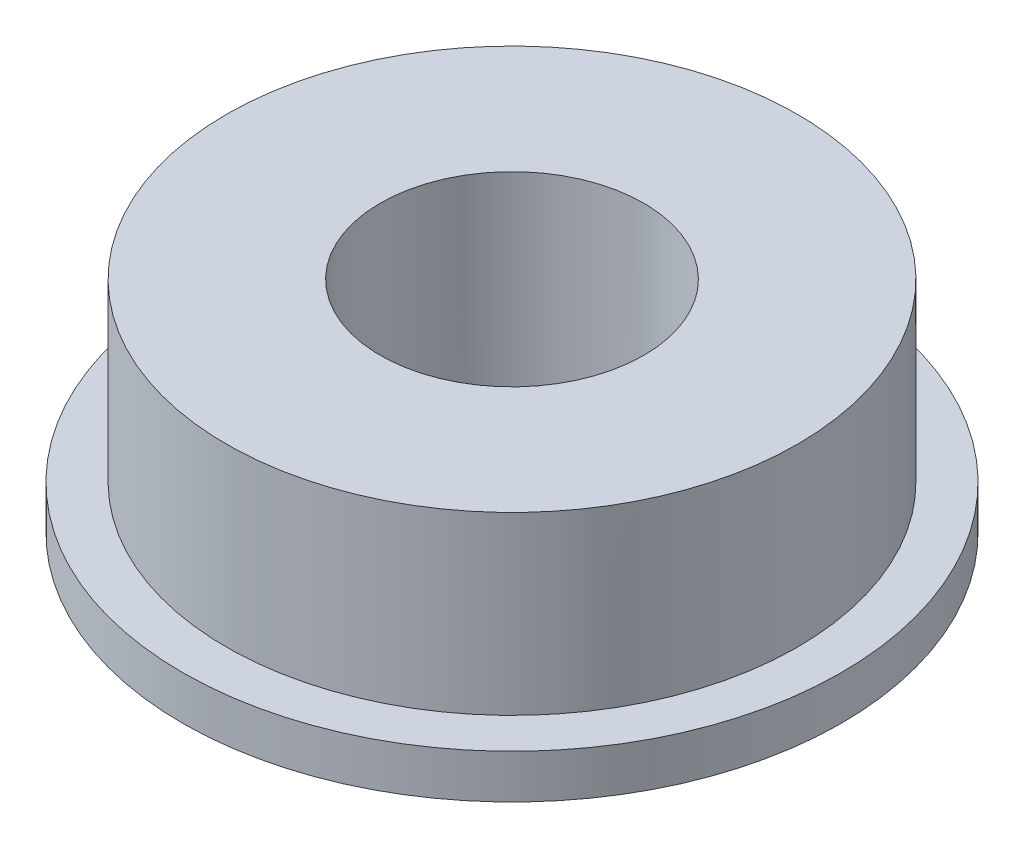
ISO-10303-21;
HEADER;
FILE_DESCRIPTION(('STEP AP214'),'2;1');
FILE_NAME('part.step','',(''),(''),'','','');
FILE_SCHEMA(('AUTOMOTIVE_DESIGN { 1 0 10303 214 1 1 1 1 }'));
ENDSEC;
DATA;
#1=APPLICATION_CONTEXT('core data for automotive mechanical design processes');
#2=APPLICATION_PROTOCOL_DEFINITION('international standard','automotive_design',2000,#1);
#3=PRODUCT_CONTEXT('',#1,'mechanical');
#4=PRODUCT('Part','Part','',(#3));
#5=PRODUCT_RELATED_PRODUCT_CATEGORY('part','',(#4));
#6=PRODUCT_DEFINITION_FORMATION('','',#4);
#7=PRODUCT_DEFINITION_CONTEXT('part definition',#1,'design');
#8=PRODUCT_DEFINITION('design','',#6,#7);
#9=PRODUCT_DEFINITION_SHAPE('','',#8);
#10=(LENGTH_UNIT() NAMED_UNIT(*) SI_UNIT(.MILLI.,.METRE.));
#11=(NAMED_UNIT(*) PLANE_ANGLE_UNIT() SI_UNIT($,.RADIAN.));
#12=(NAMED_UNIT(*) SI_UNIT($,.STERADIAN.) SOLID_ANGLE_UNIT());
#13=UNCERTAINTY_MEASURE_WITH_UNIT(LENGTH_MEASURE(1.E-05),#10,'distance_accuracy_value','');
#14=(GEOMETRIC_REPRESENTATION_CONTEXT(3) GLOBAL_UNCERTAINTY_ASSIGNED_CONTEXT((#13)) GLOBAL_UNIT_ASSIGNED_CONTEXT((#10,
#11,#12)) REPRESENTATION_CONTEXT('',''));
#15=CARTESIAN_POINT('',(0.,0.,0.));
#16=DIRECTION('',(0.,0.,1.));
#17=DIRECTION('',(1.,0.,0.));
#18=AXIS2_PLACEMENT_3D('',#15,#16,#17);
#19=CARTESIAN_POINT('',(100.000038384,-60.250004703,62.5));
#20=DIRECTION('',(0.,1.,0.));
#21=DIRECTION('',(0.704633641270668,0.,-0.709571301272564));
#22=AXIS2_PLACEMENT_3D('',#19,#20,#21);
#23=TOROIDAL_SURFACE('',#22,4.75,1.);
#24=CARTESIAN_POINT('',(100.000038384,-60.250004703,62.5));
#25=DIRECTION('',(0.,-1.,0.));
#26=DIRECTION('',(0.704633641270668,0.,-0.709571301272564));
#27=AXIS2_PLACEMENT_3D('',#24,#25,#26);
#28=CIRCLE('',#27,5.75);
#29=CARTESIAN_POINT('',(104.051681822,-60.250004703,58.419965018));
#30=VERTEX_POINT('',#29);
#31=EDGE_CURVE('E58',#30,#30,#28,.T.);
#32=ORIENTED_EDGE('',*,*,#31,.F.);
#33=CARTESIAN_POINT('',(103.34704818,-60.250004703,59.129536319));
#34=DIRECTION('',(-0.709571301272564,0.,-0.704633641270668));
#35=DIRECTION('',(0.704633641270668,0.,-0.709571301272564));
#36=AXIS2_PLACEMENT_3D('',#33,#34,#35);
#37=CIRCLE('',#36,1.);
#38=CARTESIAN_POINT('',(103.523206591,-61.21825054,58.952143494));
#39=VERTEX_POINT('',#38);
#40=EDGE_CURVE('E11',#30,#39,#37,.T.);
#41=ORIENTED_EDGE('',*,*,#40,.T.);
#42=CARTESIAN_POINT('',(100.000038384,-61.21825054,62.5));
#43=DIRECTION('',(0.,1.,0.));
#44=DIRECTION('',(0.631669392275116,0.,0.775237885337646));
#45=AXIS2_PLACEMENT_3D('',#42,#43,#44);
#46=CIRCLE('',#45,5.);
#47=CARTESIAN_POINT('',(103.158385346,-61.21825054,66.376189427));
#48=VERTEX_POINT('',#47);
#49=EDGE_CURVE('E149',#48,#39,#46,.T.);
#50=ORIENTED_EDGE('',*,*,#49,.F.);
#51=CARTESIAN_POINT('',(100.000038384,-61.21825054,62.5));
#52=DIRECTION('',(0.,1.,0.));
#53=DIRECTION('',(0.631669392275116,0.,0.775237885337646));
#54=AXIS2_PLACEMENT_3D('',#51,#52,#53);
#55=CIRCLE('',#54,5.);
#56=EDGE_CURVE('E136',#39,#48,#55,.T.);
#57=ORIENTED_EDGE('',*,*,#56,.F.);
#58=ORIENTED_EDGE('',*,*,#40,.F.);
#59=EDGE_LOOP('',(#32,#41,#50,#57,#58));
#60=FACE_BOUND('',#59,.T.);
#61=ADVANCED_FACE('F40',(#60),#23,.F.);
#62=CARTESIAN_POINT('',(100.000038384,-60.250004703,62.5));
#63=DIRECTION('',(0.,1.,0.));
#64=DIRECTION('',(0.704633641270668,0.,-0.709571301272564));
#65=AXIS2_PLACEMENT_3D('',#62,#63,#64);
#66=CYLINDRICAL_SURFACE('',#65,4.5);
#67=DIRECTION('',(0.,-1.,0.));
#68=VECTOR('',#67,1.);
#69=CARTESIAN_POINT('',(103.17088977,-61.21825054,59.306929144));
#70=LINE('',#69,#68);
#71=CARTESIAN_POINT('',(103.17088977,-61.21825054,59.306929144));
#72=VERTEX_POINT('',#71);
#73=CARTESIAN_POINT('',(103.17088977,-62.000004703,59.306929144));
#74=VERTEX_POINT('',#73);
#75=EDGE_CURVE('E50',#72,#74,#70,.T.);
#76=ORIENTED_EDGE('',*,*,#75,.T.);
#77=CARTESIAN_POINT('',(100.000038384,-62.000004703,62.5));
#78=DIRECTION('',(0.,1.,0.));
#79=DIRECTION('',(0.704633641270668,0.,-0.709571301272564));
#80=AXIS2_PLACEMENT_3D('',#77,#78,#79);
#81=CIRCLE('',#80,4.5);
#82=EDGE_CURVE('E138',#74,#74,#81,.T.);
#83=ORIENTED_EDGE('',*,*,#82,.T.);
#84=ORIENTED_EDGE('',*,*,#75,.F.);
#85=CARTESIAN_POINT('',(100.000038384,-61.21825054,62.5));
#86=DIRECTION('',(0.,1.,0.));
#87=DIRECTION('',(0.704633641270668,0.,-0.709571301272564));
#88=AXIS2_PLACEMENT_3D('',#85,#86,#87);
#89=CIRCLE('',#88,4.5);
#90=EDGE_CURVE('E128',#72,#72,#89,.T.);
#91=ORIENTED_EDGE('',*,*,#90,.F.);
#92=EDGE_LOOP('',(#76,#83,#84,#91));
#93=FACE_BOUND('',#92,.T.);
#94=ADVANCED_FACE('F193',(#93),#66,.T.);
#95=CARTESIAN_POINT('',(100.000038384,-60.250004703,62.5));
#96=DIRECTION('',(0.,1.,0.));
#97=DIRECTION('',(0.704633641270668,0.,-0.709571301272564));
#98=AXIS2_PLACEMENT_3D('',#95,#96,#97);
#99=CYLINDRICAL_SURFACE('',#98,3.);
#100=DIRECTION('',(0.,-1.,0.));
#101=VECTOR('',#100,1.);
#102=CARTESIAN_POINT('',(102.113939308,-57.000004703,60.371286096));
#103=LINE('',#102,#101);
#104=CARTESIAN_POINT('',(102.113939308,-57.000004703,60.371286096));
#105=VERTEX_POINT('',#104);
#106=CARTESIAN_POINT('',(102.113939308,-62.000004703,60.371286096));
#107=VERTEX_POINT('',#106);
#108=EDGE_CURVE('E107',#105,#107,#103,.T.);
#109=ORIENTED_EDGE('',*,*,#108,.F.);
#110=CARTESIAN_POINT('',(100.000038384,-57.000004703,62.5));
#111=DIRECTION('',(0.,1.,0.));
#112=DIRECTION('',(1.,0.,0.));
#113=AXIS2_PLACEMENT_3D('',#110,#111,#112);
#114=CIRCLE('',#113,3.);
#115=CARTESIAN_POINT('',(103.000038384,-57.000004703,62.5));
#116=VERTEX_POINT('',#115);
#117=EDGE_CURVE('E118',#105,#116,#114,.T.);
#118=ORIENTED_EDGE('',*,*,#117,.T.);
#119=CARTESIAN_POINT('',(100.000038384,-57.000004703,62.5));
#120=DIRECTION('',(0.,1.,0.));
#121=DIRECTION('',(1.,0.,0.));
#122=AXIS2_PLACEMENT_3D('',#119,#120,#121);
#123=CIRCLE('',#122,3.);
#124=EDGE_CURVE('E153',#116,#105,#123,.T.);
#125=ORIENTED_EDGE('',*,*,#124,.T.);
#126=ORIENTED_EDGE('',*,*,#108,.T.);
#127=CARTESIAN_POINT('',(100.000038384,-62.000004703,62.5));
#128=DIRECTION('',(0.,1.,0.));
#129=DIRECTION('',(0.704633641270668,0.,-0.709571301272564));
#130=AXIS2_PLACEMENT_3D('',#127,#128,#129);
#131=CIRCLE('',#130,3.);
#132=EDGE_CURVE('E44',#107,#107,#131,.T.);
#133=ORIENTED_EDGE('',*,*,#132,.F.);
#134=EDGE_LOOP('',(#109,#118,#125,#126,#133));
#135=FACE_BOUND('',#134,.T.);
#136=ADVANCED_FACE('F197',(#135),#99,.F.);
#137=CARTESIAN_POINT('',(96.806967529,-57.000004703,59.329148614));
#138=DIRECTION('',(0.,-1.,0.));
#139=DIRECTION('',(0.,0.,-1.));
#140=AXIS2_PLACEMENT_3D('',#137,#138,#139);
#141=PLANE('',#140);
#142=ORIENTED_EDGE('',*,*,#117,.F.);
#143=ORIENTED_EDGE('',*,*,#124,.F.);
#144=EDGE_LOOP('',(#142,#143));
#145=FACE_BOUND('',#144,.T.);
#146=CARTESIAN_POINT('',(100.000038384,-57.000004703,62.5));
#147=DIRECTION('',(0.,1.,0.));
#148=DIRECTION('',(1.,0.,0.));
#149=AXIS2_PLACEMENT_3D('',#146,#147,#148);
#150=CIRCLE('',#149,6.5);
#151=CARTESIAN_POINT('',(106.500038384,-57.000004703,62.5));
#152=VERTEX_POINT('',#151);
#153=CARTESIAN_POINT('',(104.105889435,-57.000004703,67.539046254));
#154=VERTEX_POINT('',#153);
#155=EDGE_CURVE('E95',#152,#154,#150,.T.);
#156=ORIENTED_EDGE('',*,*,#155,.T.);
#157=CARTESIAN_POINT('',(100.000038384,-57.000004703,62.5));
#158=DIRECTION('',(0.,1.,0.));
#159=DIRECTION('',(1.,0.,0.));
#160=AXIS2_PLACEMENT_3D('',#157,#158,#159);
#161=CIRCLE('',#160,6.5);
#162=EDGE_CURVE('E98',#154,#152,#161,.T.);
#163=ORIENTED_EDGE('',*,*,#162,.T.);
#164=EDGE_LOOP('',(#156,#163));
#165=FACE_BOUND('',#164,.T.);
#166=ADVANCED_FACE('F105',(#145,#165),#141,.F.);
#167=CARTESIAN_POINT('',(96.806967529,-62.000004703,59.329148614));
#168=DIRECTION('',(0.,1.,0.));
#169=DIRECTION('',(1.,0.,0.));
#170=AXIS2_PLACEMENT_3D('',#167,#168,#169);
#171=PLANE('',#170);
#172=ORIENTED_EDGE('',*,*,#82,.F.);
#173=EDGE_LOOP('',(#172));
#174=FACE_BOUND('',#173,.T.);
#175=ORIENTED_EDGE('',*,*,#132,.T.);
#176=EDGE_LOOP('',(#175));
#177=FACE_BOUND('',#176,.T.);
#178=ADVANCED_FACE('F203',(#174,#177),#171,.F.);
#179=CARTESIAN_POINT('',(100.000038384,-60.250004703,62.5));
#180=DIRECTION('',(0.,1.,0.));
#181=DIRECTION('',(0.631669392275116,0.,0.775237885337646));
#182=AXIS2_PLACEMENT_3D('',#179,#180,#181);
#183=CYLINDRICAL_SURFACE('',#182,6.5);
#184=DIRECTION('',(0.,-1.,0.));
#185=VECTOR('',#184,1.);
#186=CARTESIAN_POINT('',(104.105889435,-57.000004703,67.539046254));
#187=LINE('',#186,#185);
#188=CARTESIAN_POINT('',(104.105889435,-61.000004703,67.539046254));
#189=VERTEX_POINT('',#188);
#190=EDGE_CURVE('E101',#154,#189,#187,.T.);
#191=ORIENTED_EDGE('',*,*,#190,.T.);
#192=CARTESIAN_POINT('',(100.000038384,-61.000004703,62.5));
#193=DIRECTION('',(0.,1.,0.));
#194=DIRECTION('',(0.631669392275116,0.,0.775237885337646));
#195=AXIS2_PLACEMENT_3D('',#192,#193,#194);
#196=CIRCLE('',#195,6.5);
#197=EDGE_CURVE('E109',#189,#189,#196,.T.);
#198=ORIENTED_EDGE('',*,*,#197,.T.);
#199=ORIENTED_EDGE('',*,*,#190,.F.);
#200=ORIENTED_EDGE('',*,*,#155,.F.);
#201=ORIENTED_EDGE('',*,*,#162,.F.);
#202=EDGE_LOOP('',(#191,#198,#199,#200,#201));
#203=FACE_BOUND('',#202,.T.);
#204=ADVANCED_FACE('F99',(#203),#183,.T.);
#205=CARTESIAN_POINT('',(100.000038384,-60.250004703,62.5));
#206=DIRECTION('',(0.,1.,0.));
#207=DIRECTION('',(0.631669392275117,0.,0.775237885337646));
#208=AXIS2_PLACEMENT_3D('',#205,#206,#207);
#209=CYLINDRICAL_SURFACE('',#208,7.5);
#210=DIRECTION('',(0.,-1.,0.));
#211=VECTOR('',#210,1.);
#212=CARTESIAN_POINT('',(104.737558827,-61.000004703,68.31428414));
#213=LINE('',#212,#211);
#214=CARTESIAN_POINT('',(104.737558827,-61.000004703,68.31428414));
#215=VERTEX_POINT('',#214);
#216=CARTESIAN_POINT('',(104.737558827,-62.000004703,68.31428414));
#217=VERTEX_POINT('',#216);
#218=EDGE_CURVE('E114',#215,#217,#213,.T.);
#219=ORIENTED_EDGE('',*,*,#218,.T.);
#220=CARTESIAN_POINT('',(100.000038384,-62.000004703,62.5));
#221=DIRECTION('',(0.,1.,0.));
#222=DIRECTION('',(0.631669392275117,0.,0.775237885337646));
#223=AXIS2_PLACEMENT_3D('',#220,#221,#222);
#224=CIRCLE('',#223,7.5);
#225=EDGE_CURVE('E122',#217,#217,#224,.T.);
#226=ORIENTED_EDGE('',*,*,#225,.T.);
#227=ORIENTED_EDGE('',*,*,#218,.F.);
#228=CARTESIAN_POINT('',(100.000038384,-61.000004703,62.5));
#229=DIRECTION('',(0.,1.,0.));
#230=DIRECTION('',(0.631669392275117,0.,0.775237885337646));
#231=AXIS2_PLACEMENT_3D('',#228,#229,#230);
#232=CIRCLE('',#231,7.5);
#233=EDGE_CURVE('E123',#215,#215,#232,.T.);
#234=ORIENTED_EDGE('',*,*,#233,.F.);
#235=EDGE_LOOP('',(#219,#226,#227,#234));
#236=FACE_BOUND('',#235,.T.);
#237=ADVANCED_FACE('F179',(#236),#209,.T.);
#238=CARTESIAN_POINT('',(100.000038384,-60.250004703,62.5));
#239=DIRECTION('',(0.,1.,0.));
#240=DIRECTION('',(0.631669392275116,0.,0.775237885337646));
#241=AXIS2_PLACEMENT_3D('',#238,#239,#240);
#242=CYLINDRICAL_SURFACE('',#241,5.);
#243=DIRECTION('',(0.,-1.,0.));
#244=VECTOR('',#243,1.);
#245=CARTESIAN_POINT('',(103.158385346,-61.21825054,66.376189427));
#246=LINE('',#245,#244);
#247=CARTESIAN_POINT('',(103.158385346,-62.000004703,66.376189427));
#248=VERTEX_POINT('',#247);
#249=EDGE_CURVE('E133',#48,#248,#246,.T.);
#250=ORIENTED_EDGE('',*,*,#249,.F.);
#251=ORIENTED_EDGE('',*,*,#49,.T.);
#252=ORIENTED_EDGE('',*,*,#56,.T.);
#253=ORIENTED_EDGE('',*,*,#249,.T.);
#254=CARTESIAN_POINT('',(100.000038384,-62.000004703,62.5));
#255=DIRECTION('',(0.,1.,0.));
#256=DIRECTION('',(0.631669392275116,0.,0.775237885337646));
#257=AXIS2_PLACEMENT_3D('',#254,#255,#256);
#258=CIRCLE('',#257,5.);
#259=EDGE_CURVE('E127',#248,#248,#258,.T.);
#260=ORIENTED_EDGE('',*,*,#259,.F.);
#261=EDGE_LOOP('',(#250,#251,#252,#253,#260));
#262=FACE_BOUND('',#261,.T.);
#263=ADVANCED_FACE('F170',(#262),#242,.F.);
#264=CARTESIAN_POINT('',(94.96099213,-62.000004703,66.60585105));
#265=DIRECTION('',(0.,-1.,0.));
#266=DIRECTION('',(0.,0.,-1.));
#267=AXIS2_PLACEMENT_3D('',#264,#265,#266);
#268=PLANE('',#267);
#269=ORIENTED_EDGE('',*,*,#259,.T.);
#270=EDGE_LOOP('',(#269));
#271=FACE_BOUND('',#270,.T.);
#272=ORIENTED_EDGE('',*,*,#225,.F.);
#273=EDGE_LOOP('',(#272));
#274=FACE_BOUND('',#273,.T.);
#275=ADVANCED_FACE('F42',(#271,#274),#268,.T.);
#276=CARTESIAN_POINT('',(94.185754245,-61.000004703,67.237520442));
#277=DIRECTION('',(0.,1.,0.));
#278=DIRECTION('',(1.,0.,0.));
#279=AXIS2_PLACEMENT_3D('',#276,#277,#278);
#280=PLANE('',#279);
#281=ORIENTED_EDGE('',*,*,#233,.T.);
#282=EDGE_LOOP('',(#281));
#283=FACE_BOUND('',#282,.T.);
#284=ORIENTED_EDGE('',*,*,#197,.F.);
#285=EDGE_LOOP('',(#284));
#286=FACE_BOUND('',#285,.T.);
#287=ADVANCED_FACE('F174',(#283,#286),#280,.T.);
#288=CARTESIAN_POINT('',(100.000038384,-60.250004703,62.5));
#289=DIRECTION('',(0.,1.,0.));
#290=DIRECTION('',(0.704633641270668,0.,-0.709571301272564));
#291=AXIS2_PLACEMENT_3D('',#288,#289,#290);
#292=TOROIDAL_SURFACE('',#291,4.75,1.);
#293=ORIENTED_EDGE('',*,*,#31,.T.);
#294=CARTESIAN_POINT('',(103.34704818,-60.250004703,59.129536319));
#295=DIRECTION('',(-0.709571301272564,0.,-0.704633641270668));
#296=DIRECTION('',(0.704633641270668,0.,-0.709571301272564));
#297=AXIS2_PLACEMENT_3D('',#294,#295,#296);
#298=CIRCLE('',#297,1.);
#299=EDGE_CURVE('E131',#72,#30,#298,.T.);
#300=ORIENTED_EDGE('',*,*,#299,.F.);
#301=ORIENTED_EDGE('',*,*,#90,.T.);
#302=ORIENTED_EDGE('',*,*,#299,.T.);
#303=EDGE_LOOP('',(#293,#300,#301,#302));
#304=FACE_BOUND('',#303,.T.);
#305=ADVANCED_FACE('F183',(#304),#292,.F.);
#306=CLOSED_SHELL('',(#61,#94,#136,#166,#178,#204,#237,#263,#275,#287,#305));
#307=MANIFOLD_SOLID_BREP('B2',#306);
#308=ADVANCED_BREP_SHAPE_REPRESENTATION('',(#18,#307),#14);
#309=SHAPE_DEFINITION_REPRESENTATION(#9,#308);
ENDSEC;
END-ISO-10303-21;
